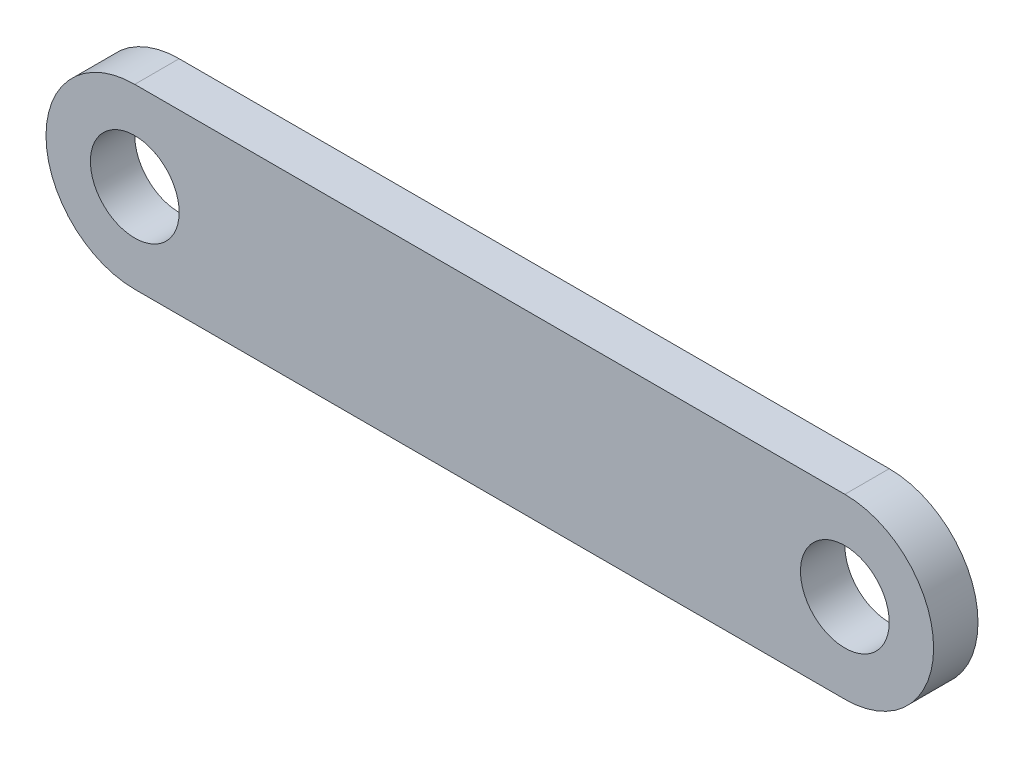
ISO-10303-21;
HEADER;
FILE_DESCRIPTION(('STEP AP214'),'2;1');
FILE_NAME('part.step','',(''),(''),'','','');
FILE_SCHEMA(('AUTOMOTIVE_DESIGN { 1 0 10303 214 1 1 1 1 }'));
ENDSEC;
DATA;
#1=APPLICATION_CONTEXT('core data for automotive mechanical design processes');
#2=APPLICATION_PROTOCOL_DEFINITION('international standard','automotive_design',2000,#1);
#3=PRODUCT_CONTEXT('',#1,'mechanical');
#4=PRODUCT('Part','Part','',(#3));
#5=PRODUCT_RELATED_PRODUCT_CATEGORY('part','',(#4));
#6=PRODUCT_DEFINITION_FORMATION('','',#4);
#7=PRODUCT_DEFINITION_CONTEXT('part definition',#1,'design');
#8=PRODUCT_DEFINITION('design','',#6,#7);
#9=PRODUCT_DEFINITION_SHAPE('','',#8);
#10=(LENGTH_UNIT() NAMED_UNIT(*) SI_UNIT(.MILLI.,.METRE.));
#11=(NAMED_UNIT(*) PLANE_ANGLE_UNIT() SI_UNIT($,.RADIAN.));
#12=(NAMED_UNIT(*) SI_UNIT($,.STERADIAN.) SOLID_ANGLE_UNIT());
#13=UNCERTAINTY_MEASURE_WITH_UNIT(LENGTH_MEASURE(1.E-05),#10,'distance_accuracy_value','');
#14=(GEOMETRIC_REPRESENTATION_CONTEXT(3) GLOBAL_UNCERTAINTY_ASSIGNED_CONTEXT((#13)) GLOBAL_UNIT_ASSIGNED_CONTEXT((#10,
#11,#12)) REPRESENTATION_CONTEXT('',''));
#15=CARTESIAN_POINT('',(0.,0.,0.));
#16=DIRECTION('',(0.,0.,1.));
#17=DIRECTION('',(1.,0.,0.));
#18=AXIS2_PLACEMENT_3D('',#15,#16,#17);
#19=CARTESIAN_POINT('',(0.,0.,1.));
#20=DIRECTION('',(0.,0.,1.));
#21=DIRECTION('',(1.,0.,0.));
#22=AXIS2_PLACEMENT_3D('',#19,#20,#21);
#23=PLANE('',#22);
#24=CARTESIAN_POINT('',(0.,0.,1.));
#25=DIRECTION('',(0.,0.,1.));
#26=DIRECTION('',(1.,0.,0.));
#27=AXIS2_PLACEMENT_3D('',#24,#25,#26);
#28=CIRCLE('',#27,2.);
#29=CARTESIAN_POINT('',(2.,0.,1.));
#30=VERTEX_POINT('',#29);
#31=EDGE_CURVE('E116',#30,#30,#28,.T.);
#32=ORIENTED_EDGE('',*,*,#31,.F.);
#33=EDGE_LOOP('',(#32));
#34=FACE_BOUND('',#33,.T.);
#35=CARTESIAN_POINT('',(0.,0.,1.));
#36=DIRECTION('',(0.,0.,1.));
#37=DIRECTION('',(1.,0.,0.));
#38=AXIS2_PLACEMENT_3D('',#35,#36,#37);
#39=CIRCLE('',#38,4.);
#40=CARTESIAN_POINT('',(0.,4.,1.));
#41=VERTEX_POINT('',#40);
#42=CARTESIAN_POINT('',(0.,-4.,1.));
#43=VERTEX_POINT('',#42);
#44=EDGE_CURVE('E96',#41,#43,#39,.T.);
#45=ORIENTED_EDGE('',*,*,#44,.T.);
#46=DIRECTION('',(1.,0.,0.));
#47=VECTOR('',#46,1.);
#48=CARTESIAN_POINT('',(0.,-4.,1.));
#49=LINE('',#48,#47);
#50=CARTESIAN_POINT('',(32.,-4.,1.));
#51=VERTEX_POINT('',#50);
#52=EDGE_CURVE('E91',#43,#51,#49,.T.);
#53=ORIENTED_EDGE('',*,*,#52,.T.);
#54=CARTESIAN_POINT('',(32.,0.,1.));
#55=DIRECTION('',(0.,0.,1.));
#56=DIRECTION('',(1.,0.,0.));
#57=AXIS2_PLACEMENT_3D('',#54,#55,#56);
#58=CIRCLE('',#57,4.);
#59=CARTESIAN_POINT('',(32.,4.,1.));
#60=VERTEX_POINT('',#59);
#61=EDGE_CURVE('E94',#51,#60,#58,.T.);
#62=ORIENTED_EDGE('',*,*,#61,.T.);
#63=DIRECTION('',(-1.,0.,0.));
#64=VECTOR('',#63,1.);
#65=CARTESIAN_POINT('',(0.,4.,1.));
#66=LINE('',#65,#64);
#67=EDGE_CURVE('E61',#60,#41,#66,.T.);
#68=ORIENTED_EDGE('',*,*,#67,.T.);
#69=EDGE_LOOP('',(#45,#53,#62,#68));
#70=FACE_BOUND('',#69,.T.);
#71=CARTESIAN_POINT('',(32.,0.,1.));
#72=DIRECTION('',(0.,0.,1.));
#73=DIRECTION('',(1.,0.,0.));
#74=AXIS2_PLACEMENT_3D('',#71,#72,#73);
#75=CIRCLE('',#74,2.);
#76=CARTESIAN_POINT('',(34.,0.,1.));
#77=VERTEX_POINT('',#76);
#78=EDGE_CURVE('E138',#77,#77,#75,.T.);
#79=ORIENTED_EDGE('',*,*,#78,.F.);
#80=EDGE_LOOP('',(#79));
#81=FACE_BOUND('',#80,.T.);
#82=ADVANCED_FACE('F43',(#34,#70,#81),#23,.T.);
#83=CARTESIAN_POINT('',(0.,0.,-1.));
#84=DIRECTION('',(0.,0.,1.));
#85=DIRECTION('',(1.,0.,0.));
#86=AXIS2_PLACEMENT_3D('',#83,#84,#85);
#87=PLANE('',#86);
#88=CARTESIAN_POINT('',(0.,0.,-1.));
#89=DIRECTION('',(0.,0.,1.));
#90=DIRECTION('',(1.,0.,0.));
#91=AXIS2_PLACEMENT_3D('',#88,#89,#90);
#92=CIRCLE('',#91,4.);
#93=CARTESIAN_POINT('',(0.,4.,-1.));
#94=VERTEX_POINT('',#93);
#95=CARTESIAN_POINT('',(0.,-4.,-1.));
#96=VERTEX_POINT('',#95);
#97=EDGE_CURVE('E112',#94,#96,#92,.T.);
#98=ORIENTED_EDGE('',*,*,#97,.F.);
#99=DIRECTION('',(-1.,0.,0.));
#100=VECTOR('',#99,1.);
#101=CARTESIAN_POINT('',(0.,4.,-1.));
#102=LINE('',#101,#100);
#103=CARTESIAN_POINT('',(32.,4.,-1.));
#104=VERTEX_POINT('',#103);
#105=EDGE_CURVE('E84',#104,#94,#102,.T.);
#106=ORIENTED_EDGE('',*,*,#105,.F.);
#107=CARTESIAN_POINT('',(32.,0.,-1.));
#108=DIRECTION('',(0.,0.,1.));
#109=DIRECTION('',(1.,0.,0.));
#110=AXIS2_PLACEMENT_3D('',#107,#108,#109);
#111=CIRCLE('',#110,4.);
#112=CARTESIAN_POINT('',(32.,-4.,-1.));
#113=VERTEX_POINT('',#112);
#114=EDGE_CURVE('E78',#113,#104,#111,.T.);
#115=ORIENTED_EDGE('',*,*,#114,.F.);
#116=DIRECTION('',(1.,0.,0.));
#117=VECTOR('',#116,1.);
#118=CARTESIAN_POINT('',(0.,-4.,-1.));
#119=LINE('',#118,#117);
#120=EDGE_CURVE('E101',#96,#113,#119,.T.);
#121=ORIENTED_EDGE('',*,*,#120,.F.);
#122=EDGE_LOOP('',(#98,#106,#115,#121));
#123=FACE_BOUND('',#122,.T.);
#124=CARTESIAN_POINT('',(0.,0.,-1.));
#125=DIRECTION('',(0.,0.,1.));
#126=DIRECTION('',(1.,0.,0.));
#127=AXIS2_PLACEMENT_3D('',#124,#125,#126);
#128=CIRCLE('',#127,2.);
#129=CARTESIAN_POINT('',(2.,0.,-1.));
#130=VERTEX_POINT('',#129);
#131=EDGE_CURVE('E134',#130,#130,#128,.T.);
#132=ORIENTED_EDGE('',*,*,#131,.T.);
#133=EDGE_LOOP('',(#132));
#134=FACE_BOUND('',#133,.T.);
#135=CARTESIAN_POINT('',(32.,0.,-1.));
#136=DIRECTION('',(0.,0.,1.));
#137=DIRECTION('',(1.,0.,0.));
#138=AXIS2_PLACEMENT_3D('',#135,#136,#137);
#139=CIRCLE('',#138,2.);
#140=CARTESIAN_POINT('',(34.,0.,-1.));
#141=VERTEX_POINT('',#140);
#142=EDGE_CURVE('E142',#141,#141,#139,.T.);
#143=ORIENTED_EDGE('',*,*,#142,.T.);
#144=EDGE_LOOP('',(#143));
#145=FACE_BOUND('',#144,.T.);
#146=ADVANCED_FACE('F129',(#123,#134,#145),#87,.F.);
#147=CARTESIAN_POINT('',(0.,0.,1.));
#148=DIRECTION('',(0.,0.,-1.));
#149=DIRECTION('',(-1.,0.,0.));
#150=AXIS2_PLACEMENT_3D('',#147,#148,#149);
#151=CYLINDRICAL_SURFACE('',#150,4.);
#152=ORIENTED_EDGE('',*,*,#97,.T.);
#153=DIRECTION('',(0.,0.,-1.));
#154=VECTOR('',#153,1.);
#155=CARTESIAN_POINT('',(0.,-4.,1.));
#156=LINE('',#155,#154);
#157=EDGE_CURVE('E11',#43,#96,#156,.T.);
#158=ORIENTED_EDGE('',*,*,#157,.F.);
#159=ORIENTED_EDGE('',*,*,#44,.F.);
#160=DIRECTION('',(0.,0.,-1.));
#161=VECTOR('',#160,1.);
#162=CARTESIAN_POINT('',(0.,4.,1.));
#163=LINE('',#162,#161);
#164=EDGE_CURVE('E108',#41,#94,#163,.T.);
#165=ORIENTED_EDGE('',*,*,#164,.T.);
#166=EDGE_LOOP('',(#152,#158,#159,#165));
#167=FACE_BOUND('',#166,.T.);
#168=ADVANCED_FACE('F45',(#167),#151,.T.);
#169=CARTESIAN_POINT('',(0.,-4.,1.));
#170=DIRECTION('',(0.,1.,0.));
#171=DIRECTION('',(0.,0.,1.));
#172=AXIS2_PLACEMENT_3D('',#169,#170,#171);
#173=PLANE('',#172);
#174=ORIENTED_EDGE('',*,*,#120,.T.);
#175=DIRECTION('',(0.,0.,-1.));
#176=VECTOR('',#175,1.);
#177=CARTESIAN_POINT('',(32.,-4.,1.));
#178=LINE('',#177,#176);
#179=EDGE_CURVE('E53',#51,#113,#178,.T.);
#180=ORIENTED_EDGE('',*,*,#179,.F.);
#181=ORIENTED_EDGE('',*,*,#52,.F.);
#182=ORIENTED_EDGE('',*,*,#157,.T.);
#183=EDGE_LOOP('',(#174,#180,#181,#182));
#184=FACE_BOUND('',#183,.T.);
#185=ADVANCED_FACE('F100',(#184),#173,.F.);
#186=CARTESIAN_POINT('',(32.,0.,1.));
#187=DIRECTION('',(0.,0.,-1.));
#188=DIRECTION('',(-1.,0.,0.));
#189=AXIS2_PLACEMENT_3D('',#186,#187,#188);
#190=CYLINDRICAL_SURFACE('',#189,4.);
#191=ORIENTED_EDGE('',*,*,#114,.T.);
#192=DIRECTION('',(0.,0.,-1.));
#193=VECTOR('',#192,1.);
#194=CARTESIAN_POINT('',(32.,4.,1.));
#195=LINE('',#194,#193);
#196=EDGE_CURVE('E103',#60,#104,#195,.T.);
#197=ORIENTED_EDGE('',*,*,#196,.F.);
#198=ORIENTED_EDGE('',*,*,#61,.F.);
#199=ORIENTED_EDGE('',*,*,#179,.T.);
#200=EDGE_LOOP('',(#191,#197,#198,#199));
#201=FACE_BOUND('',#200,.T.);
#202=ADVANCED_FACE('F104',(#201),#190,.T.);
#203=CARTESIAN_POINT('',(0.,4.,1.));
#204=DIRECTION('',(0.,-1.,0.));
#205=DIRECTION('',(0.,0.,-1.));
#206=AXIS2_PLACEMENT_3D('',#203,#204,#205);
#207=PLANE('',#206);
#208=ORIENTED_EDGE('',*,*,#105,.T.);
#209=ORIENTED_EDGE('',*,*,#164,.F.);
#210=ORIENTED_EDGE('',*,*,#67,.F.);
#211=ORIENTED_EDGE('',*,*,#196,.T.);
#212=EDGE_LOOP('',(#208,#209,#210,#211));
#213=FACE_BOUND('',#212,.T.);
#214=ADVANCED_FACE('F126',(#213),#207,.F.);
#215=CARTESIAN_POINT('',(0.,0.,1.));
#216=DIRECTION('',(0.,0.,-1.));
#217=DIRECTION('',(-1.,0.,0.));
#218=AXIS2_PLACEMENT_3D('',#215,#216,#217);
#219=CYLINDRICAL_SURFACE('',#218,2.);
#220=ORIENTED_EDGE('',*,*,#31,.T.);
#221=EDGE_LOOP('',(#220));
#222=FACE_BOUND('',#221,.T.);
#223=ORIENTED_EDGE('',*,*,#131,.F.);
#224=EDGE_LOOP('',(#223));
#225=FACE_BOUND('',#224,.T.);
#226=ADVANCED_FACE('F161',(#222,#225),#219,.F.);
#227=CARTESIAN_POINT('',(32.,0.,1.));
#228=DIRECTION('',(0.,0.,-1.));
#229=DIRECTION('',(-1.,0.,0.));
#230=AXIS2_PLACEMENT_3D('',#227,#228,#229);
#231=CYLINDRICAL_SURFACE('',#230,2.);
#232=ORIENTED_EDGE('',*,*,#78,.T.);
#233=EDGE_LOOP('',(#232));
#234=FACE_BOUND('',#233,.T.);
#235=ORIENTED_EDGE('',*,*,#142,.F.);
#236=EDGE_LOOP('',(#235));
#237=FACE_BOUND('',#236,.T.);
#238=ADVANCED_FACE('F150',(#234,#237),#231,.F.);
#239=CLOSED_SHELL('',(#82,#146,#168,#185,#202,#214,#226,#238));
#240=MANIFOLD_SOLID_BREP('B2',#239);
#241=ADVANCED_BREP_SHAPE_REPRESENTATION('',(#18,#240),#14);
#242=SHAPE_DEFINITION_REPRESENTATION(#9,#241);
ENDSEC;
END-ISO-10303-21;
